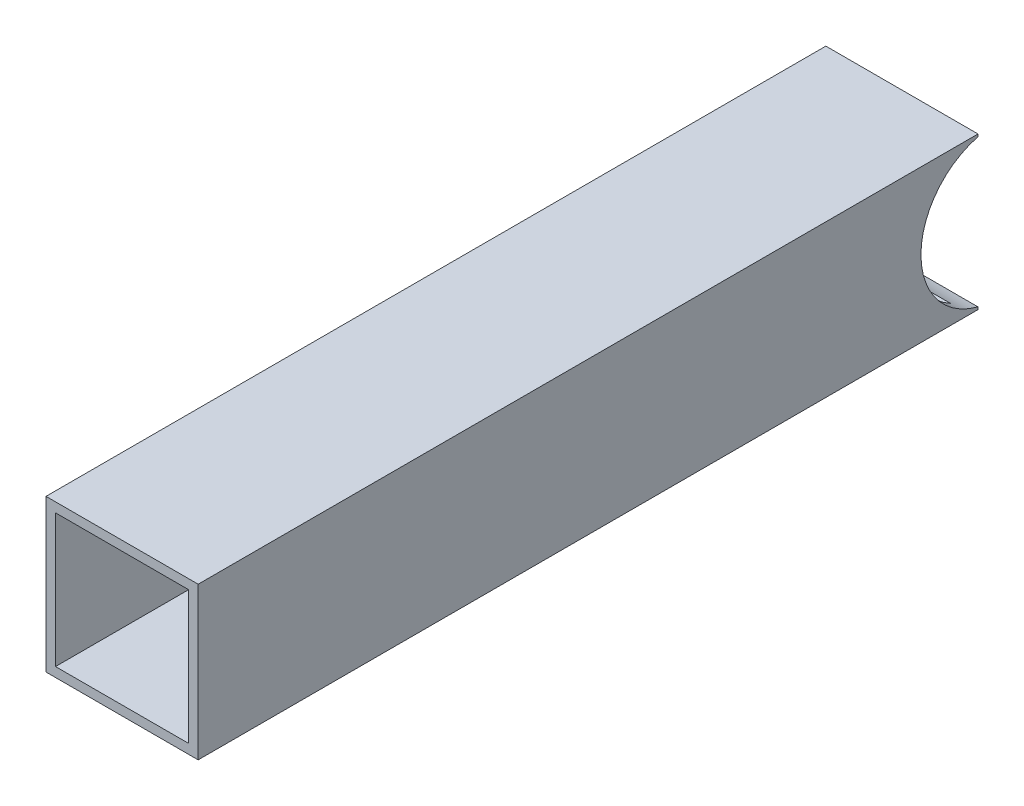
ISO-10303-21;
HEADER;
FILE_DESCRIPTION(('STEP AP214'),'2;1');
FILE_NAME('part.step','',(''),(''),'','','');
FILE_SCHEMA(('AUTOMOTIVE_DESIGN { 1 0 10303 214 1 1 1 1 }'));
ENDSEC;
DATA;
#1=APPLICATION_CONTEXT('core data for automotive mechanical design processes');
#2=APPLICATION_PROTOCOL_DEFINITION('international standard','automotive_design',2000,#1);
#3=PRODUCT_CONTEXT('',#1,'mechanical');
#4=PRODUCT('Part','Part','',(#3));
#5=PRODUCT_RELATED_PRODUCT_CATEGORY('part','',(#4));
#6=PRODUCT_DEFINITION_FORMATION('','',#4);
#7=PRODUCT_DEFINITION_CONTEXT('part definition',#1,'design');
#8=PRODUCT_DEFINITION('design','',#6,#7);
#9=PRODUCT_DEFINITION_SHAPE('','',#8);
#10=(LENGTH_UNIT() NAMED_UNIT(*) SI_UNIT(.MILLI.,.METRE.));
#11=(NAMED_UNIT(*) PLANE_ANGLE_UNIT() SI_UNIT($,.RADIAN.));
#12=(NAMED_UNIT(*) SI_UNIT($,.STERADIAN.) SOLID_ANGLE_UNIT());
#13=UNCERTAINTY_MEASURE_WITH_UNIT(LENGTH_MEASURE(1.E-05),#10,'distance_accuracy_value','');
#14=(GEOMETRIC_REPRESENTATION_CONTEXT(3) GLOBAL_UNCERTAINTY_ASSIGNED_CONTEXT((#13)) GLOBAL_UNIT_ASSIGNED_CONTEXT((#10,
#11,#12)) REPRESENTATION_CONTEXT('',''));
#15=CARTESIAN_POINT('',(0.,0.,0.));
#16=DIRECTION('',(0.,0.,1.));
#17=DIRECTION('',(1.,0.,0.));
#18=AXIS2_PLACEMENT_3D('',#15,#16,#17);
#19=CARTESIAN_POINT('',(0.,0.,-260.35));
#20=DIRECTION('',(0.,0.,1.));
#21=DIRECTION('',(-1.,0.,0.));
#22=AXIS2_PLACEMENT_3D('',#19,#20,#21);
#23=PLANE('',#22);
#24=DIRECTION('',(0.,-1.,0.));
#25=VECTOR('',#24,1.);
#26=CARTESIAN_POINT('',(0.,0.,-260.35));
#27=LINE('',#26,#25);
#28=CARTESIAN_POINT('',(0.,50.8,-260.35));
#29=VERTEX_POINT('',#28);
#30=CARTESIAN_POINT('',(0.,49.9934442484171,-260.35));
#31=VERTEX_POINT('',#30);
#32=EDGE_CURVE('E126',#29,#31,#27,.T.);
#33=ORIENTED_EDGE('',*,*,#32,.F.);
#34=DIRECTION('',(-1.,0.,0.));
#35=VECTOR('',#34,1.);
#36=CARTESIAN_POINT('',(0.,50.8,-260.35));
#37=LINE('',#36,#35);
#38=CARTESIAN_POINT('',(50.8,50.8,-260.35));
#39=VERTEX_POINT('',#38);
#40=EDGE_CURVE('E147',#39,#29,#37,.T.);
#41=ORIENTED_EDGE('',*,*,#40,.F.);
#42=DIRECTION('',(0.,1.,0.));
#43=VECTOR('',#42,1.);
#44=CARTESIAN_POINT('',(50.8,0.,-260.35));
#45=LINE('',#44,#43);
#46=CARTESIAN_POINT('',(50.8,49.9934442484171,-260.35));
#47=VERTEX_POINT('',#46);
#48=EDGE_CURVE('E128',#47,#39,#45,.T.);
#49=ORIENTED_EDGE('',*,*,#48,.F.);
#50=DIRECTION('',(1.,0.,0.));
#51=VECTOR('',#50,1.);
#52=CARTESIAN_POINT('',(0.,49.9934442484171,-260.35));
#53=LINE('',#52,#51);
#54=EDGE_CURVE('E114',#31,#47,#53,.T.);
#55=ORIENTED_EDGE('',*,*,#54,.F.);
#56=EDGE_LOOP('',(#33,#41,#49,#55));
#57=FACE_BOUND('',#56,.T.);
#58=ADVANCED_FACE('F37',(#57),#23,.F.);
#59=CARTESIAN_POINT('',(50.8,0.,-260.35));
#60=VERTEX_POINT('',#59);
#61=CARTESIAN_POINT('',(50.8,0.806555751582911,-260.35));
#62=VERTEX_POINT('',#61);
#63=EDGE_CURVE('E144',#60,#62,#45,.T.);
#64=ORIENTED_EDGE('',*,*,#63,.F.);
#65=DIRECTION('',(1.,0.,0.));
#66=VECTOR('',#65,1.);
#67=CARTESIAN_POINT('',(0.,0.,-260.35));
#68=LINE('',#67,#66);
#69=CARTESIAN_POINT('',(0.,0.,-260.35));
#70=VERTEX_POINT('',#69);
#71=EDGE_CURVE('E134',#70,#60,#68,.T.);
#72=ORIENTED_EDGE('',*,*,#71,.F.);
#73=CARTESIAN_POINT('',(0.,0.806555751582911,-260.35));
#74=VERTEX_POINT('',#73);
#75=EDGE_CURVE('E135',#74,#70,#27,.T.);
#76=ORIENTED_EDGE('',*,*,#75,.F.);
#77=DIRECTION('',(1.,0.,0.));
#78=VECTOR('',#77,1.);
#79=CARTESIAN_POINT('',(0.,0.806555751582911,-260.35));
#80=LINE('',#79,#78);
#81=EDGE_CURVE('E116',#62,#74,#80,.F.);
#82=ORIENTED_EDGE('',*,*,#81,.F.);
#83=EDGE_LOOP('',(#64,#72,#76,#82));
#84=FACE_BOUND('',#83,.T.);
#85=ADVANCED_FACE('F225',(#84),#23,.F.);
#86=CARTESIAN_POINT('',(0.,0.,0.));
#87=DIRECTION('',(0.,0.,1.));
#88=DIRECTION('',(-1.,0.,0.));
#89=AXIS2_PLACEMENT_3D('',#86,#87,#88);
#90=PLANE('',#89);
#91=DIRECTION('',(0.,-1.,0.));
#92=VECTOR('',#91,1.);
#93=CARTESIAN_POINT('',(0.,0.,0.));
#94=LINE('',#93,#92);
#95=CARTESIAN_POINT('',(0.,50.8,0.));
#96=VERTEX_POINT('',#95);
#97=CARTESIAN_POINT('',(0.,0.,0.));
#98=VERTEX_POINT('',#97);
#99=EDGE_CURVE('E149',#96,#98,#94,.T.);
#100=ORIENTED_EDGE('',*,*,#99,.T.);
#101=DIRECTION('',(1.,0.,0.));
#102=VECTOR('',#101,1.);
#103=CARTESIAN_POINT('',(0.,0.,0.));
#104=LINE('',#103,#102);
#105=CARTESIAN_POINT('',(50.8,0.,0.));
#106=VERTEX_POINT('',#105);
#107=EDGE_CURVE('E152',#98,#106,#104,.T.);
#108=ORIENTED_EDGE('',*,*,#107,.T.);
#109=DIRECTION('',(0.,1.,0.));
#110=VECTOR('',#109,1.);
#111=CARTESIAN_POINT('',(50.8,0.,0.));
#112=LINE('',#111,#110);
#113=CARTESIAN_POINT('',(50.8,50.8,0.));
#114=VERTEX_POINT('',#113);
#115=EDGE_CURVE('E155',#106,#114,#112,.T.);
#116=ORIENTED_EDGE('',*,*,#115,.T.);
#117=DIRECTION('',(-1.,0.,0.));
#118=VECTOR('',#117,1.);
#119=CARTESIAN_POINT('',(0.,50.8,0.));
#120=LINE('',#119,#118);
#121=EDGE_CURVE('E139',#114,#96,#120,.T.);
#122=ORIENTED_EDGE('',*,*,#121,.T.);
#123=EDGE_LOOP('',(#100,#108,#116,#122));
#124=FACE_BOUND('',#123,.T.);
#125=DIRECTION('',(-1.,0.,0.));
#126=VECTOR('',#125,1.);
#127=CARTESIAN_POINT('',(3.175,47.625,0.));
#128=LINE('',#127,#126);
#129=CARTESIAN_POINT('',(47.625,47.625,0.));
#130=VERTEX_POINT('',#129);
#131=CARTESIAN_POINT('',(3.175,47.625,0.));
#132=VERTEX_POINT('',#131);
#133=EDGE_CURVE('E195',#130,#132,#128,.T.);
#134=ORIENTED_EDGE('',*,*,#133,.F.);
#135=DIRECTION('',(0.,1.,0.));
#136=VECTOR('',#135,1.);
#137=CARTESIAN_POINT('',(47.625,3.175,0.));
#138=LINE('',#137,#136);
#139=CARTESIAN_POINT('',(47.625,3.175,0.));
#140=VERTEX_POINT('',#139);
#141=EDGE_CURVE('E192',#140,#130,#138,.T.);
#142=ORIENTED_EDGE('',*,*,#141,.F.);
#143=DIRECTION('',(1.,0.,0.));
#144=VECTOR('',#143,1.);
#145=CARTESIAN_POINT('',(3.175,3.175,0.));
#146=LINE('',#145,#144);
#147=CARTESIAN_POINT('',(3.175,3.175,0.));
#148=VERTEX_POINT('',#147);
#149=EDGE_CURVE('E189',#148,#140,#146,.T.);
#150=ORIENTED_EDGE('',*,*,#149,.F.);
#151=DIRECTION('',(0.,-1.,0.));
#152=VECTOR('',#151,1.);
#153=CARTESIAN_POINT('',(3.175,3.175,0.));
#154=LINE('',#153,#152);
#155=EDGE_CURVE('E129',#132,#148,#154,.T.);
#156=ORIENTED_EDGE('',*,*,#155,.F.);
#157=EDGE_LOOP('',(#134,#142,#150,#156));
#158=FACE_BOUND('',#157,.T.);
#159=ADVANCED_FACE('F170',(#124,#158),#90,.T.);
#160=CARTESIAN_POINT('',(0.,0.,-260.35));
#161=DIRECTION('',(1.,0.,0.));
#162=DIRECTION('',(0.,0.,1.));
#163=AXIS2_PLACEMENT_3D('',#160,#161,#162);
#164=PLANE('',#163);
#165=ORIENTED_EDGE('',*,*,#75,.T.);
#166=DIRECTION('',(0.,0.,1.));
#167=VECTOR('',#166,1.);
#168=CARTESIAN_POINT('',(0.,0.,-260.35));
#169=LINE('',#168,#167);
#170=EDGE_CURVE('E45',#70,#98,#169,.T.);
#171=ORIENTED_EDGE('',*,*,#170,.T.);
#172=ORIENTED_EDGE('',*,*,#99,.F.);
#173=DIRECTION('',(0.,0.,1.));
#174=VECTOR('',#173,1.);
#175=CARTESIAN_POINT('',(0.,50.8,-260.35));
#176=LINE('',#175,#174);
#177=EDGE_CURVE('E132',#29,#96,#176,.T.);
#178=ORIENTED_EDGE('',*,*,#177,.F.);
#179=ORIENTED_EDGE('',*,*,#32,.T.);
#180=CARTESIAN_POINT('',(0.,25.4,-266.7));
#181=DIRECTION('',(-1.,0.,0.));
#182=DIRECTION('',(0.,0.,1.));
#183=AXIS2_PLACEMENT_3D('',#180,#181,#182);
#184=CIRCLE('',#183,25.4);
#185=EDGE_CURVE('E111',#74,#31,#184,.T.);
#186=ORIENTED_EDGE('',*,*,#185,.F.);
#187=EDGE_LOOP('',(#165,#171,#172,#178,#179,#186));
#188=FACE_BOUND('',#187,.T.);
#189=ADVANCED_FACE('F39',(#188),#164,.F.);
#190=CARTESIAN_POINT('',(0.,0.,-260.35));
#191=DIRECTION('',(0.,1.,0.));
#192=DIRECTION('',(0.,0.,-1.));
#193=AXIS2_PLACEMENT_3D('',#190,#191,#192);
#194=PLANE('',#193);
#195=ORIENTED_EDGE('',*,*,#107,.F.);
#196=ORIENTED_EDGE('',*,*,#170,.F.);
#197=ORIENTED_EDGE('',*,*,#71,.T.);
#198=DIRECTION('',(0.,0.,1.));
#199=VECTOR('',#198,1.);
#200=CARTESIAN_POINT('',(50.8,0.,-260.35));
#201=LINE('',#200,#199);
#202=EDGE_CURVE('E163',#60,#106,#201,.T.);
#203=ORIENTED_EDGE('',*,*,#202,.T.);
#204=EDGE_LOOP('',(#195,#196,#197,#203));
#205=FACE_BOUND('',#204,.T.);
#206=ADVANCED_FACE('F167',(#205),#194,.F.);
#207=CARTESIAN_POINT('',(50.8,0.,-260.35));
#208=DIRECTION('',(-1.,0.,0.));
#209=DIRECTION('',(0.,0.,-1.));
#210=AXIS2_PLACEMENT_3D('',#207,#208,#209);
#211=PLANE('',#210);
#212=ORIENTED_EDGE('',*,*,#48,.T.);
#213=DIRECTION('',(0.,0.,1.));
#214=VECTOR('',#213,1.);
#215=CARTESIAN_POINT('',(50.8,50.8,-260.35));
#216=LINE('',#215,#214);
#217=EDGE_CURVE('E161',#39,#114,#216,.T.);
#218=ORIENTED_EDGE('',*,*,#217,.T.);
#219=ORIENTED_EDGE('',*,*,#115,.F.);
#220=ORIENTED_EDGE('',*,*,#202,.F.);
#221=ORIENTED_EDGE('',*,*,#63,.T.);
#222=CARTESIAN_POINT('',(50.8,25.4,-266.7));
#223=DIRECTION('',(-1.,0.,0.));
#224=DIRECTION('',(0.,0.,1.));
#225=AXIS2_PLACEMENT_3D('',#222,#223,#224);
#226=CIRCLE('',#225,25.4);
#227=EDGE_CURVE('E52',#62,#47,#226,.T.);
#228=ORIENTED_EDGE('',*,*,#227,.T.);
#229=EDGE_LOOP('',(#212,#218,#219,#220,#221,#228));
#230=FACE_BOUND('',#229,.T.);
#231=ADVANCED_FACE('F176',(#230),#211,.F.);
#232=CARTESIAN_POINT('',(0.,50.8,-260.35));
#233=DIRECTION('',(0.,-1.,0.));
#234=DIRECTION('',(0.,0.,1.));
#235=AXIS2_PLACEMENT_3D('',#232,#233,#234);
#236=PLANE('',#235);
#237=ORIENTED_EDGE('',*,*,#121,.F.);
#238=ORIENTED_EDGE('',*,*,#217,.F.);
#239=ORIENTED_EDGE('',*,*,#40,.T.);
#240=ORIENTED_EDGE('',*,*,#177,.T.);
#241=EDGE_LOOP('',(#237,#238,#239,#240));
#242=FACE_BOUND('',#241,.T.);
#243=ADVANCED_FACE('F174',(#242),#236,.F.);
#244=CARTESIAN_POINT('',(3.175,3.175,-260.35));
#245=DIRECTION('',(1.,0.,0.));
#246=DIRECTION('',(0.,0.,1.));
#247=AXIS2_PLACEMENT_3D('',#244,#245,#246);
#248=PLANE('',#247);
#249=CARTESIAN_POINT('',(3.175,25.4,-266.7));
#250=DIRECTION('',(-1.,0.,0.));
#251=DIRECTION('',(0.,0.,1.));
#252=AXIS2_PLACEMENT_3D('',#249,#250,#251);
#253=CIRCLE('',#252,25.4);
#254=CARTESIAN_POINT('',(3.175,3.175,-254.403277875791));
#255=VERTEX_POINT('',#254);
#256=CARTESIAN_POINT('',(3.175,47.625,-254.403277875791));
#257=VERTEX_POINT('',#256);
#258=EDGE_CURVE('E183',#255,#257,#253,.T.);
#259=ORIENTED_EDGE('',*,*,#258,.T.);
#260=DIRECTION('',(0.,0.,1.));
#261=VECTOR('',#260,1.);
#262=CARTESIAN_POINT('',(3.175,47.625,-260.35));
#263=LINE('',#262,#261);
#264=EDGE_CURVE('E198',#257,#132,#263,.T.);
#265=ORIENTED_EDGE('',*,*,#264,.T.);
#266=ORIENTED_EDGE('',*,*,#155,.T.);
#267=DIRECTION('',(0.,0.,1.));
#268=VECTOR('',#267,1.);
#269=CARTESIAN_POINT('',(3.175,3.175,-260.35));
#270=LINE('',#269,#268);
#271=EDGE_CURVE('E141',#255,#148,#270,.T.);
#272=ORIENTED_EDGE('',*,*,#271,.F.);
#273=EDGE_LOOP('',(#259,#265,#266,#272));
#274=FACE_BOUND('',#273,.T.);
#275=ADVANCED_FACE('F212',(#274),#248,.T.);
#276=CARTESIAN_POINT('',(3.175,3.175,-260.35));
#277=DIRECTION('',(0.,1.,0.));
#278=DIRECTION('',(0.,0.,-1.));
#279=AXIS2_PLACEMENT_3D('',#276,#277,#278);
#280=PLANE('',#279);
#281=DIRECTION('',(1.,0.,0.));
#282=VECTOR('',#281,1.);
#283=CARTESIAN_POINT('',(0.,3.175,-254.403277875791));
#284=LINE('',#283,#282);
#285=CARTESIAN_POINT('',(47.625,3.175,-254.403277875791));
#286=VERTEX_POINT('',#285);
#287=EDGE_CURVE('E181',#286,#255,#284,.F.);
#288=ORIENTED_EDGE('',*,*,#287,.T.);
#289=ORIENTED_EDGE('',*,*,#271,.T.);
#290=ORIENTED_EDGE('',*,*,#149,.T.);
#291=DIRECTION('',(0.,0.,1.));
#292=VECTOR('',#291,1.);
#293=CARTESIAN_POINT('',(47.625,3.175,-260.35));
#294=LINE('',#293,#292);
#295=EDGE_CURVE('E201',#286,#140,#294,.T.);
#296=ORIENTED_EDGE('',*,*,#295,.F.);
#297=EDGE_LOOP('',(#288,#289,#290,#296));
#298=FACE_BOUND('',#297,.T.);
#299=ADVANCED_FACE('F206',(#298),#280,.T.);
#300=CARTESIAN_POINT('',(47.625,3.175,-260.35));
#301=DIRECTION('',(-1.,0.,0.));
#302=DIRECTION('',(0.,0.,-1.));
#303=AXIS2_PLACEMENT_3D('',#300,#301,#302);
#304=PLANE('',#303);
#305=CARTESIAN_POINT('',(47.625,25.4,-266.7));
#306=DIRECTION('',(1.,0.,0.));
#307=DIRECTION('',(0.,0.,-1.));
#308=AXIS2_PLACEMENT_3D('',#305,#306,#307);
#309=CIRCLE('',#308,25.4);
#310=CARTESIAN_POINT('',(47.625,47.625,-254.403277875791));
#311=VERTEX_POINT('',#310);
#312=EDGE_CURVE('E121',#311,#286,#309,.T.);
#313=ORIENTED_EDGE('',*,*,#312,.T.);
#314=ORIENTED_EDGE('',*,*,#295,.T.);
#315=ORIENTED_EDGE('',*,*,#141,.T.);
#316=DIRECTION('',(0.,0.,1.));
#317=VECTOR('',#316,1.);
#318=CARTESIAN_POINT('',(47.625,47.625,-260.35));
#319=LINE('',#318,#317);
#320=EDGE_CURVE('E200',#311,#130,#319,.T.);
#321=ORIENTED_EDGE('',*,*,#320,.F.);
#322=EDGE_LOOP('',(#313,#314,#315,#321));
#323=FACE_BOUND('',#322,.T.);
#324=ADVANCED_FACE('F215',(#323),#304,.T.);
#325=CARTESIAN_POINT('',(3.175,47.625,-260.35));
#326=DIRECTION('',(0.,-1.,0.));
#327=DIRECTION('',(0.,0.,1.));
#328=AXIS2_PLACEMENT_3D('',#325,#326,#327);
#329=PLANE('',#328);
#330=DIRECTION('',(1.,0.,0.));
#331=VECTOR('',#330,1.);
#332=CARTESIAN_POINT('',(0.,47.625,-254.403277875791));
#333=LINE('',#332,#331);
#334=EDGE_CURVE('E11',#257,#311,#333,.T.);
#335=ORIENTED_EDGE('',*,*,#334,.T.);
#336=ORIENTED_EDGE('',*,*,#320,.T.);
#337=ORIENTED_EDGE('',*,*,#133,.T.);
#338=ORIENTED_EDGE('',*,*,#264,.F.);
#339=EDGE_LOOP('',(#335,#336,#337,#338));
#340=FACE_BOUND('',#339,.T.);
#341=ADVANCED_FACE('F218',(#340),#329,.T.);
#342=CARTESIAN_POINT('',(0.,25.4,-266.7));
#343=DIRECTION('',(1.,0.,0.));
#344=DIRECTION('',(0.,0.,1.));
#345=AXIS2_PLACEMENT_3D('',#342,#343,#344);
#346=CYLINDRICAL_SURFACE('',#345,25.4);
#347=ORIENTED_EDGE('',*,*,#258,.F.);
#348=ORIENTED_EDGE('',*,*,#287,.F.);
#349=ORIENTED_EDGE('',*,*,#312,.F.);
#350=ORIENTED_EDGE('',*,*,#334,.F.);
#351=EDGE_LOOP('',(#347,#348,#349,#350));
#352=FACE_BOUND('',#351,.T.);
#353=ORIENTED_EDGE('',*,*,#185,.T.);
#354=ORIENTED_EDGE('',*,*,#54,.T.);
#355=ORIENTED_EDGE('',*,*,#227,.F.);
#356=ORIENTED_EDGE('',*,*,#81,.T.);
#357=EDGE_LOOP('',(#353,#354,#355,#356));
#358=FACE_BOUND('',#357,.T.);
#359=ADVANCED_FACE('F113',(#352,#358),#346,.F.);
#360=CLOSED_SHELL('',(#58,#85,#159,#189,#206,#231,#243,#275,#299,#324,#341,#359));
#361=MANIFOLD_SOLID_BREP('B2',#360);
#362=ADVANCED_BREP_SHAPE_REPRESENTATION('',(#18,#361),#14);
#363=SHAPE_DEFINITION_REPRESENTATION(#9,#362);
ENDSEC;
END-ISO-10303-21;
